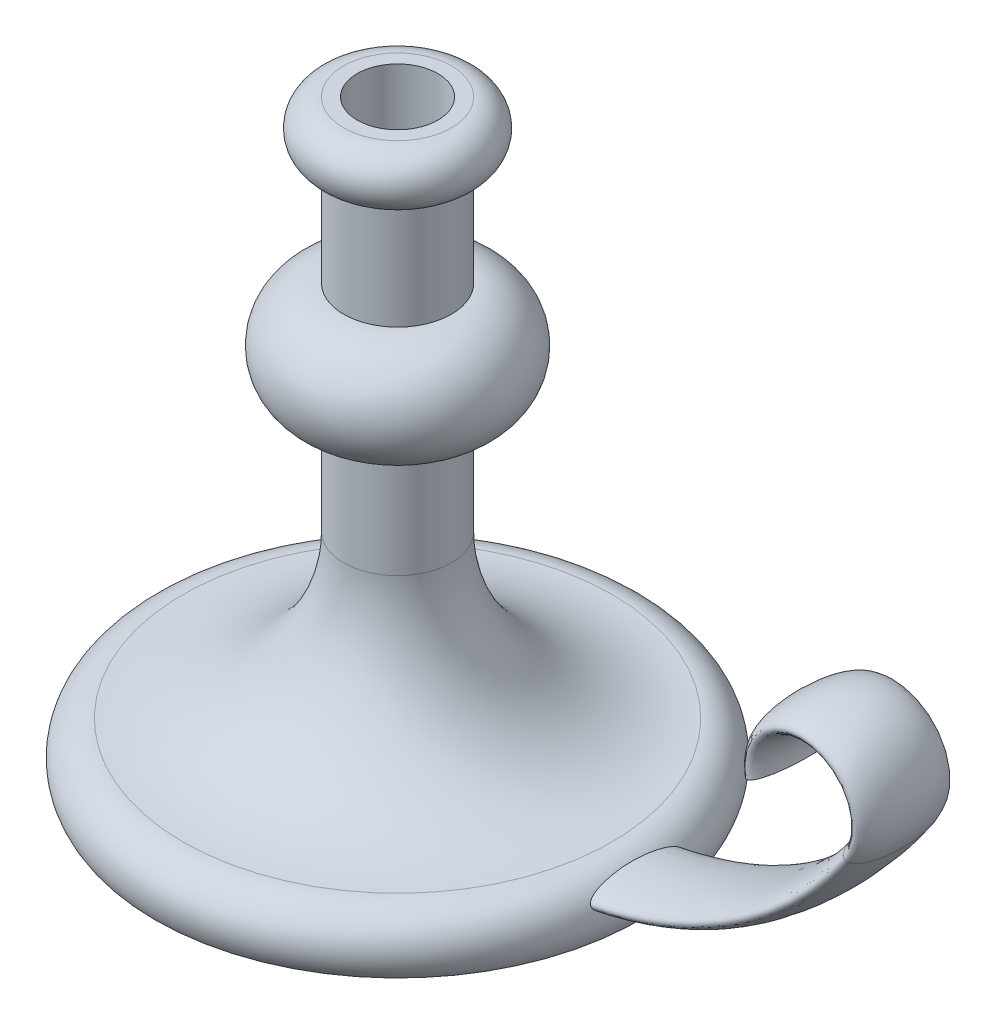
ISO-10303-21;
HEADER;
FILE_DESCRIPTION(('STEP AP214'),'2;1');
FILE_NAME('part.step','',(''),(''),'','','');
FILE_SCHEMA(('AUTOMOTIVE_DESIGN { 1 0 10303 214 1 1 1 1 }'));
ENDSEC;
DATA;
#1=APPLICATION_CONTEXT('core data for automotive mechanical design processes');
#2=APPLICATION_PROTOCOL_DEFINITION('international standard','automotive_design',2000,#1);
#3=PRODUCT_CONTEXT('',#1,'mechanical');
#4=PRODUCT('Part','Part','',(#3));
#5=PRODUCT_RELATED_PRODUCT_CATEGORY('part','',(#4));
#6=PRODUCT_DEFINITION_FORMATION('','',#4);
#7=PRODUCT_DEFINITION_CONTEXT('part definition',#1,'design');
#8=PRODUCT_DEFINITION('design','',#6,#7);
#9=PRODUCT_DEFINITION_SHAPE('','',#8);
#10=(LENGTH_UNIT() NAMED_UNIT(*) SI_UNIT(.MILLI.,.METRE.));
#11=(NAMED_UNIT(*) PLANE_ANGLE_UNIT() SI_UNIT($,.RADIAN.));
#12=(NAMED_UNIT(*) SI_UNIT($,.STERADIAN.) SOLID_ANGLE_UNIT());
#13=UNCERTAINTY_MEASURE_WITH_UNIT(LENGTH_MEASURE(1.E-05),#10,'distance_accuracy_value','');
#14=(GEOMETRIC_REPRESENTATION_CONTEXT(3) GLOBAL_UNCERTAINTY_ASSIGNED_CONTEXT((#13)) GLOBAL_UNIT_ASSIGNED_CONTEXT((#10,
#11,#12)) REPRESENTATION_CONTEXT('',''));
#15=CARTESIAN_POINT('',(0.,0.,0.));
#16=DIRECTION('',(0.,0.,1.));
#17=DIRECTION('',(1.,0.,0.));
#18=AXIS2_PLACEMENT_3D('',#15,#16,#17);
#19=CARTESIAN_POINT('',(0.,0.,0.));
#20=DIRECTION('',(0.,-1.,0.));
#21=DIRECTION('',(0.,0.,-1.));
#22=AXIS2_PLACEMENT_3D('',#19,#20,#21);
#23=PLANE('',#22);
#24=CARTESIAN_POINT('',(0.,0.,0.));
#25=DIRECTION('',(0.,-1.,0.));
#26=DIRECTION('',(0.,0.,-1.));
#27=AXIS2_PLACEMENT_3D('',#24,#25,#26);
#28=CIRCLE('',#27,90.);
#29=CARTESIAN_POINT('',(0.,0.,-90.));
#30=VERTEX_POINT('',#29);
#31=EDGE_CURVE('E79',#30,#30,#28,.T.);
#32=ORIENTED_EDGE('',*,*,#31,.T.);
#33=EDGE_LOOP('',(#32));
#34=FACE_BOUND('',#33,.T.);
#35=ADVANCED_FACE('F39',(#34),#23,.T.);
#36=CARTESIAN_POINT('',(0.,220.,0.));
#37=DIRECTION('',(0.,1.,0.));
#38=DIRECTION('',(0.,0.,1.));
#39=AXIS2_PLACEMENT_3D('',#36,#37,#38);
#40=PLANE('',#39);
#41=CARTESIAN_POINT('',(0.,220.,0.));
#42=DIRECTION('',(0.,1.,0.));
#43=DIRECTION('',(0.,0.,1.));
#44=AXIS2_PLACEMENT_3D('',#41,#42,#43);
#45=CIRCLE('',#44,15.);
#46=CARTESIAN_POINT('',(0.,220.,15.));
#47=VERTEX_POINT('',#46);
#48=EDGE_CURVE('E92',#47,#47,#45,.T.);
#49=ORIENTED_EDGE('',*,*,#48,.F.);
#50=EDGE_LOOP('',(#49));
#51=FACE_BOUND('',#50,.T.);
#52=CARTESIAN_POINT('',(0.,220.,0.));
#53=DIRECTION('',(0.,-1.,0.));
#54=DIRECTION('',(0.,0.,-1.));
#55=AXIS2_PLACEMENT_3D('',#52,#53,#54);
#56=CIRCLE('',#55,20.);
#57=CARTESIAN_POINT('',(0.,220.,-20.));
#58=VERTEX_POINT('',#57);
#59=EDGE_CURVE('E51',#58,#58,#56,.T.);
#60=ORIENTED_EDGE('',*,*,#59,.F.);
#61=EDGE_LOOP('',(#60));
#62=FACE_BOUND('',#61,.T.);
#63=ADVANCED_FACE('F110',(#51,#62),#40,.T.);
#64=CARTESIAN_POINT('',(0.,210.,0.));
#65=DIRECTION('',(0.,-1.,0.));
#66=DIRECTION('',(0.,0.,-1.));
#67=AXIS2_PLACEMENT_3D('',#64,#65,#66);
#68=TOROIDAL_SURFACE('',#67,20.,10.);
#69=ORIENTED_EDGE('',*,*,#59,.T.);
#70=EDGE_LOOP('',(#69));
#71=FACE_BOUND('',#70,.T.);
#72=CARTESIAN_POINT('',(0.,200.,0.));
#73=DIRECTION('',(0.,-1.,0.));
#74=DIRECTION('',(0.,0.,-1.));
#75=AXIS2_PLACEMENT_3D('',#72,#73,#74);
#76=CIRCLE('',#75,20.);
#77=CARTESIAN_POINT('',(0.,200.,-20.));
#78=VERTEX_POINT('',#77);
#79=EDGE_CURVE('E56',#78,#78,#76,.T.);
#80=ORIENTED_EDGE('',*,*,#79,.F.);
#81=EDGE_LOOP('',(#80));
#82=FACE_BOUND('',#81,.T.);
#83=ADVANCED_FACE('F113',(#71,#82),#68,.T.);
#84=CARTESIAN_POINT('',(0.,0.,0.));
#85=DIRECTION('',(0.,-1.,0.));
#86=DIRECTION('',(0.,0.,-1.));
#87=AXIS2_PLACEMENT_3D('',#84,#85,#86);
#88=CYLINDRICAL_SURFACE('',#87,20.);
#89=ORIENTED_EDGE('',*,*,#79,.T.);
#90=EDGE_LOOP('',(#89));
#91=FACE_BOUND('',#90,.T.);
#92=CARTESIAN_POINT('',(0.,160.,0.));
#93=DIRECTION('',(0.,-1.,0.));
#94=DIRECTION('',(0.,0.,-1.));
#95=AXIS2_PLACEMENT_3D('',#92,#93,#94);
#96=CIRCLE('',#95,20.);
#97=CARTESIAN_POINT('',(0.,160.,-20.));
#98=VERTEX_POINT('',#97);
#99=EDGE_CURVE('E61',#98,#98,#96,.T.);
#100=ORIENTED_EDGE('',*,*,#99,.F.);
#101=EDGE_LOOP('',(#100));
#102=FACE_BOUND('',#101,.T.);
#103=ADVANCED_FACE('F118',(#91,#102),#88,.T.);
#104=CARTESIAN_POINT('',(0.,140.,0.));
#105=DIRECTION('',(0.,-1.,0.));
#106=DIRECTION('',(0.,0.,-1.));
#107=AXIS2_PLACEMENT_3D('',#104,#105,#106);
#108=TOROIDAL_SURFACE('',#107,20.,20.);
#109=ORIENTED_EDGE('',*,*,#99,.T.);
#110=EDGE_LOOP('',(#109));
#111=FACE_BOUND('',#110,.T.);
#112=CARTESIAN_POINT('',(0.,120.,0.));
#113=DIRECTION('',(0.,-1.,0.));
#114=DIRECTION('',(0.,0.,-1.));
#115=AXIS2_PLACEMENT_3D('',#112,#113,#114);
#116=CIRCLE('',#115,20.);
#117=CARTESIAN_POINT('',(0.,120.,-20.));
#118=VERTEX_POINT('',#117);
#119=EDGE_CURVE('E67',#118,#118,#116,.T.);
#120=ORIENTED_EDGE('',*,*,#119,.F.);
#121=EDGE_LOOP('',(#120));
#122=FACE_BOUND('',#121,.T.);
#123=ADVANCED_FACE('F124',(#111,#122),#108,.T.);
#124=CARTESIAN_POINT('',(0.,0.,0.));
#125=DIRECTION('',(0.,-1.,0.));
#126=DIRECTION('',(0.,0.,-1.));
#127=AXIS2_PLACEMENT_3D('',#124,#125,#126);
#128=CYLINDRICAL_SURFACE('',#127,20.);
#129=ORIENTED_EDGE('',*,*,#119,.T.);
#130=EDGE_LOOP('',(#129));
#131=FACE_BOUND('',#130,.T.);
#132=CARTESIAN_POINT('',(0.,80.,0.));
#133=DIRECTION('',(0.,-1.,0.));
#134=DIRECTION('',(0.,0.,-1.));
#135=AXIS2_PLACEMENT_3D('',#132,#133,#134);
#136=CIRCLE('',#135,20.);
#137=CARTESIAN_POINT('',(0.,80.,-20.));
#138=VERTEX_POINT('',#137);
#139=EDGE_CURVE('E71',#138,#138,#136,.T.);
#140=ORIENTED_EDGE('',*,*,#139,.F.);
#141=EDGE_LOOP('',(#140));
#142=FACE_BOUND('',#141,.T.);
#143=ADVANCED_FACE('F128',(#131,#142),#128,.T.);
#144=CARTESIAN_POINT('',(0.,80.,0.));
#145=DIRECTION('',(0.,-1.,0.));
#146=DIRECTION('',(0.,0.,-1.));
#147=AXIS2_PLACEMENT_3D('',#144,#145,#146);
#148=TOROIDAL_SURFACE('',#147,80.,60.);
#149=ORIENTED_EDGE('',*,*,#139,.T.);
#150=EDGE_LOOP('',(#149));
#151=FACE_BOUND('',#150,.T.);
#152=CARTESIAN_POINT('',(0.,20.0007443694136,0.));
#153=DIRECTION('',(0.,-1.,0.));
#154=DIRECTION('',(0.,0.,-1.));
#155=AXIS2_PLACEMENT_3D('',#152,#153,#154);
#156=CIRCLE('',#155,79.7011291657719);
#157=CARTESIAN_POINT('',(0.,20.0007443694136,-79.7011291657719));
#158=VERTEX_POINT('',#157);
#159=EDGE_CURVE('E75',#158,#158,#156,.T.);
#160=ORIENTED_EDGE('',*,*,#159,.F.);
#161=EDGE_LOOP('',(#160));
#162=FACE_BOUND('',#161,.T.);
#163=ADVANCED_FACE('F132',(#151,#162),#148,.F.);
#164=CARTESIAN_POINT('',(0.,7.31626714425586,0.));
#165=DIRECTION('',(0.,-1.,0.));
#166=DIRECTION('',(0.,0.,-1.));
#167=AXIS2_PLACEMENT_3D('',#164,#165,#166);
#168=TOROIDAL_SURFACE('',#167,79.6379447103951,12.6846345927247);
#169=CARTESIAN_POINT('',(89.331592359006,12.8957591036713,17.5));
#170=CARTESIAN_POINT('',(89.3528716315899,12.8531232664558,17.5000036298484));
#171=CARTESIAN_POINT('',(89.3742501925081,12.8105547612886,17.4977749194986));
#172=CARTESIAN_POINT('',(89.417043392844,12.7258834846006,17.4889673870824));
#173=CARTESIAN_POINT('',(89.4384580379587,12.6837807965263,17.4823877980299));
#174=CARTESIAN_POINT('',(89.5025363259207,12.5586045254097,17.456393580704));
#175=CARTESIAN_POINT('',(89.5450197770193,12.4766918736474,17.4307237235594));
#176=CARTESIAN_POINT('',(89.6406017454437,12.2946910967917,17.355926513326));
#177=CARTESIAN_POINT('',(89.6931706980714,12.1962942561243,17.3021342095068));
#178=CARTESIAN_POINT('',(89.7948763242913,12.0087598824078,17.1777574554219));
#179=CARTESIAN_POINT('',(89.844003949467,11.9196464797963,17.1071307391182));
#180=CARTESIAN_POINT('',(89.9330537848641,11.7603446608938,16.9633621664622));
#181=CARTESIAN_POINT('',(89.973374135657,11.6891676003732,16.8915321206787));
#182=CARTESIAN_POINT('',(90.051537415588,11.552758939122,16.741128077223));
#183=CARTESIAN_POINT('',(90.0893782142737,11.4875324327647,16.6625484107612));
#184=CARTESIAN_POINT('',(90.1628708848921,11.3621997381895,16.5002316378956));
#185=CARTESIAN_POINT('',(90.198518700364,11.3021029635716,16.4164855157216));
#186=CARTESIAN_POINT('',(90.2677931344468,11.1864799888541,16.2451597473206));
#187=CARTESIAN_POINT('',(90.3014203342554,11.1309524727662,16.1575812160722));
#188=CARTESIAN_POINT('',(90.3714571178723,11.0163813355403,15.9669622665593));
#189=CARTESIAN_POINT('',(90.4075996960735,10.957929166113,15.8634702414445));
#190=CARTESIAN_POINT('',(90.4778389759083,10.8454518468641,15.6534350197472));
#191=CARTESIAN_POINT('',(90.5119354406711,10.7914272093371,15.5468914720025));
#192=CARTESIAN_POINT('',(90.5782505385626,10.6873201846696,15.3315569876787));
#193=CARTESIAN_POINT('',(90.6104720603554,10.6372316891334,15.222769877891));
#194=CARTESIAN_POINT('',(90.673275686305,10.540443972785,15.0032494469884));
#195=CARTESIAN_POINT('',(90.7038578886355,10.493744548953,14.8925162429473));
#196=CARTESIAN_POINT('',(90.7737583891013,10.3878677608794,14.6312336071376));
#197=CARTESIAN_POINT('',(90.8124812173465,10.3298949948671,14.4800371070918));
#198=CARTESIAN_POINT('',(90.8875472436256,10.2186232524545,14.1753399722133));
#199=CARTESIAN_POINT('',(90.9238901049236,10.1653249370708,14.021839015089));
#200=CARTESIAN_POINT('',(90.9944609048068,10.0627775363203,13.7128145380783));
#201=CARTESIAN_POINT('',(91.0286864280601,10.0135330549033,13.557288944686));
#202=CARTESIAN_POINT('',(91.0951630132822,9.91869953725797,13.244704908244));
#203=CARTESIAN_POINT('',(91.1274139478919,9.87311073675893,13.0876463670766));
#204=CARTESIAN_POINT('',(91.2214665821271,9.74120657190673,12.6144069914983));
#205=CARTESIAN_POINT('',(91.2805355176612,9.65980049269619,12.2963069613394));
#206=CARTESIAN_POINT('',(91.3925695029603,9.50742822340805,11.6548154303461));
#207=CARTESIAN_POINT('',(91.4455014603195,9.43651811031221,11.3314050880674));
#208=CARTESIAN_POINT('',(91.5455046163852,9.30408939971677,10.6820437671839));
#209=CARTESIAN_POINT('',(91.5925802615152,9.24256366897103,10.356094918241));
#210=CARTESIAN_POINT('',(91.6813705724448,9.12767540315217,9.70210271905873));
#211=CARTESIAN_POINT('',(91.7230860774511,9.07431158996437,9.37405970515349));
#212=CARTESIAN_POINT('',(91.80210205921,8.97410128813368,8.71129392750408));
#213=CARTESIAN_POINT('',(91.8393259731192,8.92736592912732,8.3765453165988));
#214=CARTESIAN_POINT('',(91.9088792561761,8.84069383195887,7.70566141492581));
#215=CARTESIAN_POINT('',(91.9412084483891,8.80075733955607,7.36952607448149));
#216=CARTESIAN_POINT('',(92.0311897061726,8.69028861732564,6.35930166729121));
#217=CARTESIAN_POINT('',(92.0818184338585,8.62911846282349,5.68353887282034));
#218=CARTESIAN_POINT('',(92.1653544449105,8.528915699696,4.33105522544168));
#219=CARTESIAN_POINT('',(92.1983056977362,8.48982815166778,3.65434098679839));
#220=CARTESIAN_POINT('',(92.2472906751491,8.43192360316733,2.29942023089839));
#221=CARTESIAN_POINT('',(92.2633239958661,8.41310708661115,1.62121367840398));
#222=CARTESIAN_POINT('',(92.2778397445579,8.39607181650987,0.343960471331731));
#223=CARTESIAN_POINT('',(92.2781604370463,8.39569566899582,-0.255039117845261));
#224=CARTESIAN_POINT('',(92.2658325466088,8.41016273961668,-1.4528166686833));
#225=CARTESIAN_POINT('',(92.253182027507,8.4250082298421,-2.05159458390782));
#226=CARTESIAN_POINT('',(92.2147353255428,8.470380034667,-3.24833655747918));
#227=CARTESIAN_POINT('',(92.1889348979051,8.50091141267835,-3.84630029047619));
#228=CARTESIAN_POINT('',(92.1237707343957,8.57870111012282,-5.0412990932736));
#229=CARTESIAN_POINT('',(92.084386974914,8.62598412648128,-5.63833147758658));
#230=CARTESIAN_POINT('',(91.991450603915,8.73891348371119,-6.82944653891416));
#231=CARTESIAN_POINT('',(91.9379017463258,8.80455495962487,-7.42352995500957));
#232=CARTESIAN_POINT('',(91.8462001332358,8.91878741069747,-8.31126483343779));
#233=CARTESIAN_POINT('',(91.8137459250727,8.95948131605918,-8.60653918163226));
#234=CARTESIAN_POINT('',(91.7448551252587,9.04661442029298,-9.19576808539778));
#235=CARTESIAN_POINT('',(91.7084187102134,9.09305336439224,-9.48972269889588));
#236=CARTESIAN_POINT('',(91.6313131503896,9.19229484905741,-10.0761621606462));
#237=CARTESIAN_POINT('',(91.5906418354418,9.24510065452449,-10.3686461740147));
#238=CARTESIAN_POINT('',(91.5047743899102,9.35783568382189,-10.9516205734937));
#239=CARTESIAN_POINT('',(91.4595776645317,9.417765844232,-11.242110692162));
#240=CARTESIAN_POINT('',(91.3642333240636,9.54579722051748,-11.8206934470067));
#241=CARTESIAN_POINT('',(91.3140824035886,9.61390389828953,-12.1087843415796));
#242=CARTESIAN_POINT('',(91.2083961647205,9.75950694534379,-12.6811132804984));
#243=CARTESIAN_POINT('',(91.1528693058418,9.83698860874519,-12.9653566009956));
#244=CARTESIAN_POINT('',(91.0356437753436,10.003260298756,-13.529135914604));
#245=CARTESIAN_POINT('',(90.9739482389594,10.0920445870036,-13.8086742154847));
#246=CARTESIAN_POINT('',(90.8759775106589,10.235723217141,-14.2228866134028));
#247=CARTESIAN_POINT('',(90.842433310285,10.2853403122764,-14.3600440737252));
#248=CARTESIAN_POINT('',(90.7733376340875,10.3885611124623,-14.6323323486204));
#249=CARTESIAN_POINT('',(90.7377863518709,10.4421644331516,-14.7674633570825));
#250=CARTESIAN_POINT('',(90.6607763579514,10.5595243741388,-15.0486247180798));
#251=CARTESIAN_POINT('',(90.619082520898,10.6237602414905,-15.1943922927362));
#252=CARTESIAN_POINT('',(90.5325813159539,10.7587579555331,-15.4820339503066));
#253=CARTESIAN_POINT('',(90.4877727417693,10.8295223341353,-15.6239064947225));
#254=CARTESIAN_POINT('',(90.3947481854828,10.9785316692766,-15.9017182872334));
#255=CARTESIAN_POINT('',(90.3465474135609,11.0567437272694,-16.0376800885217));
#256=CARTESIAN_POINT('',(90.245957850172,11.2225349834868,-16.3020758844232));
#257=CARTESIAN_POINT('',(90.1935732428495,11.3101048521198,-16.4305171826557));
#258=CARTESIAN_POINT('',(90.0950078431896,11.4777705158856,-16.6512777465277));
#259=CARTESIAN_POINT('',(90.0497481753715,11.5557343019329,-16.7456135259041));
#260=CARTESIAN_POINT('',(89.9554721128961,11.720591315673,-16.9246930831411));
#261=CARTESIAN_POINT('',(89.906449449035,11.8074995307326,-17.0094202446332));
#262=CARTESIAN_POINT('',(89.8296045202293,11.9459851277386,-17.1262686815797));
#263=CARTESIAN_POINT('',(89.8032390846774,11.9938693169556,-17.1637389684981));
#264=CARTESIAN_POINT('',(89.7494837402016,12.0923289163028,-17.2342002888381));
#265=CARTESIAN_POINT('',(89.722093698745,12.1429046749473,-17.2671907402202));
#266=CARTESIAN_POINT('',(89.6664470358401,12.2465607097923,-17.3276633715996));
#267=CARTESIAN_POINT('',(89.638193560291,12.2996322030883,-17.355163308521));
#268=CARTESIAN_POINT('',(89.5809128237969,12.4081943999189,-17.4037677528346));
#269=CARTESIAN_POINT('',(89.5518860867268,12.4636834809888,-17.4248764760473));
#270=CARTESIAN_POINT('',(89.483222479244,12.596139523701,-17.4657054782123));
#271=CARTESIAN_POINT('',(89.4433623818072,12.6739432337966,-17.4824642549507));
#272=CARTESIAN_POINT('',(89.3637017821655,12.8313154890446,-17.5008355582578));
#273=CARTESIAN_POINT('',(89.3239012577142,12.910882722149,-17.502458989763));
#274=CARTESIAN_POINT('',(89.2455102181624,13.0693757470002,-17.4902982190755));
#275=CARTESIAN_POINT('',(89.2069192396707,13.1483017755984,-17.4765199934856));
#276=CARTESIAN_POINT('',(89.1318434533162,13.3034102691417,-17.4349447077809));
#277=CARTESIAN_POINT('',(89.095360855041,13.3795898254266,-17.4071332274237));
#278=CARTESIAN_POINT('',(89.0107284365554,13.5578748719522,-17.3261632367215));
#279=CARTESIAN_POINT('',(88.9638469155511,13.6579660745915,-17.2672994741846));
#280=CARTESIAN_POINT('',(88.8752468009856,13.8489495323135,-17.1331172581495));
#281=CARTESIAN_POINT('',(88.8335416103374,13.9398178003752,-17.0577574295354));
#282=CARTESIAN_POINT('',(88.7588108430003,14.1038379686959,-16.9041719662642));
#283=CARTESIAN_POINT('',(88.7253336696562,14.1778494650969,-16.8270606350012));
#284=CARTESIAN_POINT('',(88.6614671569186,14.3197569733581,-16.6661582628088));
#285=CARTESIAN_POINT('',(88.6310805325556,14.387647602225,-16.5823614620815));
#286=CARTESIAN_POINT('',(88.5728570912034,14.5182080538585,-16.4096516177783));
#287=CARTESIAN_POINT('',(88.5450267582966,14.5808645656565,-16.3207264471473));
#288=CARTESIAN_POINT('',(88.4915926302374,14.7014631877479,-16.139166948396));
#289=CARTESIAN_POINT('',(88.4659880378696,14.7594069855583,-16.0465339658467));
#290=CARTESIAN_POINT('',(88.4162633044117,14.8720977924002,-15.8568660767383));
#291=CARTESIAN_POINT('',(88.392173279038,14.926779236368,-15.7597845729235));
#292=CARTESIAN_POINT('',(88.3456463173741,15.0324480575824,-15.56323584348));
#293=CARTESIAN_POINT('',(88.3232096749754,15.0834347780592,-15.4637681978556));
#294=CARTESIAN_POINT('',(88.2579617276854,15.2316648274762,-15.162195159253));
#295=CARTESIAN_POINT('',(88.2172871763785,15.3240079881752,-14.9572136843656));
#296=CARTESIAN_POINT('',(88.1402735962302,15.4982932943206,-14.5419563709813));
#297=CARTESIAN_POINT('',(88.1039383710524,15.5802263186583,-14.3316760804489));
#298=CARTESIAN_POINT('',(88.0346037188983,15.7357645468321,-13.90647004583));
#299=CARTESIAN_POINT('',(88.0016195831202,15.8093317442382,-13.6915280015502));
#300=CARTESIAN_POINT('',(87.9385811329796,15.9489866103288,-13.259096277495));
#301=CARTESIAN_POINT('',(87.9085235640724,16.0150826009927,-13.0416097361016));
#302=CARTESIAN_POINT('',(87.8508656630047,16.1408735494464,-12.6045456099856));
#303=CARTESIAN_POINT('',(87.8232646855787,16.2005701889817,-12.3849685912364));
#304=CARTESIAN_POINT('',(87.7636985636154,16.3282797050062,-11.8901725135972));
#305=CARTESIAN_POINT('',(87.7323183455989,16.3947527138723,-11.6144865183409));
#306=CARTESIAN_POINT('',(87.6724276272482,16.5201523600373,-11.0610808271048));
#307=CARTESIAN_POINT('',(87.6439174018875,16.5790782743972,-10.7833609389873));
#308=CARTESIAN_POINT('',(87.5894700969832,16.6902641866094,-10.2262012323957));
#309=CARTESIAN_POINT('',(87.563534290015,16.7425208913776,-9.94676063511619));
#310=CARTESIAN_POINT('',(87.5140610849197,16.8410016965775,-9.38660255069569));
#311=CARTESIAN_POINT('',(87.4905237968001,16.8872255203401,-9.10588500560411));
#312=CARTESIAN_POINT('',(87.4234454451566,17.0174088308054,-8.26387531041082));
#313=CARTESIAN_POINT('',(87.3832752040462,17.0932090143356,-7.70103951583022));
#314=CARTESIAN_POINT('',(87.3114739326301,17.2260446214976,-6.57279812325387));
#315=CARTESIAN_POINT('',(87.2798409934517,17.2830842404669,-6.0073931285074));
#316=CARTESIAN_POINT('',(87.2250955058804,17.3802696449732,-4.87615781282562));
#317=CARTESIAN_POINT('',(87.2019618684402,17.4204572803456,-4.31033208345654));
#318=CARTESIAN_POINT('',(87.1641805820016,17.4854146083387,-3.17749023414733));
#319=CARTESIAN_POINT('',(87.1495334330816,17.510183392388,-2.61047404603318));
#320=CARTESIAN_POINT('',(87.1288289686007,17.5450408981076,-1.47561664407422));
#321=CARTESIAN_POINT('',(87.1227750129476,17.5551238777209,-0.907775194372782));
#322=CARTESIAN_POINT('',(87.1193237820083,17.5608842905552,0.227987776251134));
#323=CARTESIAN_POINT('',(87.1219261642648,17.5565622936579,0.795909293117199));
#324=CARTESIAN_POINT('',(87.1344455598773,17.5355868628083,1.82339056913373));
#325=CARTESIAN_POINT('',(87.1428776455311,17.5214344484496,2.2830215329929));
#326=CARTESIAN_POINT('',(87.165354479205,17.483320341416,3.20173858962035));
#327=CARTESIAN_POINT('',(87.1793991549583,17.4593587750421,3.66082468932789));
#328=CARTESIAN_POINT('',(87.21304222729,17.4011576428215,4.57806436661276));
#329=CARTESIAN_POINT('',(87.2326396743792,17.3669198340889,5.03621809014247));
#330=CARTESIAN_POINT('',(87.27735289828,17.2874532320298,5.95129709759704));
#331=CARTESIAN_POINT('',(87.3024684667521,17.2422248536509,6.40822242724142));
#332=CARTESIAN_POINT('',(87.3491991993318,17.1563873224842,7.17228098420321));
#333=CARTESIAN_POINT('',(87.3693028838554,17.1190469792123,7.47987660342441));
#334=CARTESIAN_POINT('',(87.4120924938199,17.0384628386665,8.09411160670261));
#335=CARTESIAN_POINT('',(87.4347783585978,16.9952191800739,8.40075101305005));
#336=CARTESIAN_POINT('',(87.4828159617157,16.9023160980562,9.01276460373634));
#337=CARTESIAN_POINT('',(87.5081669758935,16.8526584165859,9.31813910844866));
#338=CARTESIAN_POINT('',(87.5616923150876,16.7462533017768,9.92740188743243));
#339=CARTESIAN_POINT('',(87.5898665440548,16.6895061096155,10.2312902118968));
#340=CARTESIAN_POINT('',(87.6404095389,16.5862010558457,10.7466522816931));
#341=CARTESIAN_POINT('',(87.661997625522,16.5416649124325,10.9586085960539));
#342=CARTESIAN_POINT('',(87.7068092076462,16.4483037303251,11.3813988712093));
#343=CARTESIAN_POINT('',(87.7300326550759,16.3994788176918,11.5922328647994));
#344=CARTESIAN_POINT('',(87.7782956292146,16.2970511976029,12.012664729903));
#345=CARTESIAN_POINT('',(87.8033362096123,16.2434457138786,12.2222618067706));
#346=CARTESIAN_POINT('',(87.8554462296387,16.1309098617006,12.6397681020805));
#347=CARTESIAN_POINT('',(87.882515605796,16.0719796598199,12.8476773731007));
#348=CARTESIAN_POINT('',(87.9384106163237,15.9493381868072,13.2571267957373));
#349=CARTESIAN_POINT('',(87.9671887834081,15.8857499142039,13.4587100740162));
#350=CARTESIAN_POINT('',(88.02737820529,15.7518889749847,13.8592458384641));
#351=CARTESIAN_POINT('',(88.058789234617,15.6816168806823,14.0581985482214));
#352=CARTESIAN_POINT('',(88.1247800039194,15.5332512700918,14.4525556682108));
#353=CARTESIAN_POINT('',(88.1593584324042,15.4551609897611,14.64796150726));
#354=CARTESIAN_POINT('',(88.2324559024922,15.2895883406964,15.0339849567474));
#355=CARTESIAN_POINT('',(88.2709734269471,15.2021095873093,15.2246043757119));
#356=CARTESIAN_POINT('',(88.3344351128477,15.0579283496447,15.5139045689998));
#357=CARTESIAN_POINT('',(88.3575955831162,15.0052999424311,15.6150095331601));
#358=CARTESIAN_POINT('',(88.4056857955521,14.8961074482309,15.8146327216121));
#359=CARTESIAN_POINT('',(88.4306152090903,14.8395440923062,15.913151421738));
#360=CARTESIAN_POINT('',(88.4825569322437,14.721907889443,16.1069052802867));
#361=CARTESIAN_POINT('',(88.5095691614144,14.6608352166714,16.2021405653194));
#362=CARTESIAN_POINT('',(88.5660632571339,14.533499751445,16.3883056231103));
#363=CARTESIAN_POINT('',(88.5955442272001,14.467238843575,16.4792369401694));
#364=CARTESIAN_POINT('',(88.6468225484703,14.3525118896444,16.6250678854621));
#365=CARTESIAN_POINT('',(88.6677764252503,14.3057610043701,16.6816062204874));
#366=CARTESIAN_POINT('',(88.7111186114716,14.2094154985263,16.7916201337275));
#367=CARTESIAN_POINT('',(88.7335071924788,14.1598203397704,16.845095128453));
#368=CARTESIAN_POINT('',(88.8030278722002,14.0064961524021,16.9997389447878));
#369=CARTESIAN_POINT('',(88.8526124678244,13.8980089778055,17.0954154709312));
#370=CARTESIAN_POINT('',(88.9415230587185,13.705959011399,17.2351168874825));
#371=CARTESIAN_POINT('',(88.9787232364164,13.6262169849745,17.2857089605743));
#372=CARTESIAN_POINT('',(89.0565936578377,13.4609890820443,17.3729355384276));
#373=CARTESIAN_POINT('',(89.0972567305421,13.3755151497378,17.4095980678659));
#374=CARTESIAN_POINT('',(89.1701600842742,13.2240691632156,17.4578764099612));
#375=CARTESIAN_POINT('',(89.201709335693,13.1590643163121,17.4735824653783));
#376=CARTESIAN_POINT('',(89.2659573398479,13.0279054584701,17.4946406543723));
#377=CARTESIAN_POINT('',(89.2986559148603,12.9617516259964,17.4999943816549));
#378=CARTESIAN_POINT('',(89.331592359006,12.8957591036713,17.5));
#379=B_SPLINE_CURVE_WITH_KNOTS('',3,(#169,#170,#171,#172,#173,#174,#175,#176,#177,#178,#179,
#180,#181,#182,#183,#184,#185,#186,#187,#188,#189,#190,#191,#192,#193,#194,#195,#196,#197,#198,
#199,#200,#201,#202,#203,#204,#205,#206,#207,#208,#209,#210,#211,#212,#213,#214,#215,#216,#217,
#218,#219,#220,#221,#222,#223,#224,#225,#226,#227,#228,#229,#230,#231,#232,#233,#234,#235,#236,
#237,#238,#239,#240,#241,#242,#243,#244,#245,#246,#247,#248,#249,#250,#251,#252,#253,#254,#255,
#256,#257,#258,#259,#260,#261,#262,#263,#264,#265,#266,#267,#268,#269,#270,#271,#272,#273,#274,
#275,#276,#277,#278,#279,#280,#281,#282,#283,#284,#285,#286,#287,#288,#289,#290,#291,#292,#293,
#294,#295,#296,#297,#298,#299,#300,#301,#302,#303,#304,#305,#306,#307,#308,#309,#310,#311,#312,
#313,#314,#315,#316,#317,#318,#319,#320,#321,#322,#323,#324,#325,#326,#327,#328,#329,#330,#331,
#332,#333,#334,#335,#336,#337,#338,#339,#340,#341,#342,#343,#344,#345,#346,#347,#348,#349,#350,
#351,#352,#353,#354,#355,#356,#357,#358,#359,#360,#361,#362,#363,#364,#365,#366,#367,#368,#369,
#370,#371,#372,#373,#374,#375,#376,#377,#378),.UNSPECIFIED.,.T.,.F.,(4,2,2,2,2,2,2,2,2,2,2,2,2,
2,2,2,2,2,2,2,2,2,2,2,2,2,2,2,2,2,2,2,2,2,2,2,2,2,2,2,2,2,2,2,2,2,2,2,2,2,2,2,2,2,2,2,2,2,2,2,2,
2,2,2,2,2,2,2,2,2,2,2,2,2,2,2,2,2,2,2,2,2,2,2,2,2,2,2,2,2,2,2,2,2,2,2,2,2,2,2,2,2,2,2,4),(0.,
0.142871130676715,0.285767453826701,0.571656342954518,0.941162647848684,1.31160662711154,
1.63773130893978,1.96413262189904,2.29112058519849,2.6180140409261,2.99054648209707,
3.36312196704892,3.73510734954214,4.10707043009936,4.60643388797761,5.10586784764714,
5.60586140755434,6.10588718267089,7.1064046434528,8.1120882927423,9.11700365192395,
10.1217614850111,11.1417591811313,12.1617937393817,14.2023040305025,16.2377151159935,
18.2731747903408,20.06985262205,21.866798677788,23.6643251533404,25.4645128246685,
27.2642239008725,28.1636369379067,29.0630101033338,29.9628464410653,30.8628012038988,
31.7633605150741,32.6625250631046,33.5612349108893,34.0101620807981,34.4590460200965,
34.9528573545866,35.4468610124018,35.9387756754464,36.4302044037402,36.8211660755513,
37.2127938546731,37.411439858664,37.6101116469578,37.8081301128386,38.0060176742879,
38.2718036811643,38.5373981758089,38.8028896424534,39.0686544791582,39.4421945936006,
39.8166825743099,40.1522002264279,40.4880101282851,40.8246495642241,41.1611679215234,
41.5030427526031,41.8449782066576,42.5298898549097,43.2153975274471,43.9039045966367,
44.5916370372081,45.2791882967364,46.1349942070956,46.9908820342275,47.8471908549941,
48.7035389324694,50.4110614233153,52.1182018088452,53.821077247168,55.5240530196625,
57.2276944663687,58.9312685153595,60.3109169432188,61.6905476074964,63.0699425057426,
64.4492853331921,65.3807421670122,66.3121771226905,67.2433596440495,68.1745104962037,
68.8274405731581,69.4803514648104,70.1336440283002,70.7869161619312,71.426776144862,
72.0665813879447,72.7061229010909,73.3454190150207,73.6942680956393,74.0430525368658,
74.3918235137488,74.7404683849102,74.9692353594728,75.1980457644962,75.6545461783821,
75.9581623511506,76.2611644062994,76.4823369857487,76.7034755137229),.UNSPECIFIED.);
#380=CARTESIAN_POINT('',(89.331592359006,12.8957591036713,17.5));
#381=VERTEX_POINT('',#380);
#382=EDGE_CURVE('E10',#381,#381,#379,.T.);
#383=ORIENTED_EDGE('',*,*,#382,.F.);
#384=EDGE_LOOP('',(#383));
#385=FACE_BOUND('',#384,.T.);
#386=ORIENTED_EDGE('',*,*,#159,.T.);
#387=EDGE_LOOP('',(#386));
#388=FACE_BOUND('',#387,.T.);
#389=ORIENTED_EDGE('',*,*,#31,.F.);
#390=EDGE_LOOP('',(#389));
#391=FACE_BOUND('',#390,.T.);
#392=ADVANCED_FACE('F135',(#385,#388,#391),#168,.T.);
#393=CARTESIAN_POINT('',(147.448696612485,82.6850279349348,0.));
#394=DIRECTION('',(0.182415269919928,-0.983221576909315,0.));
#395=DIRECTION('',(0.,0.,-1.));
#396=AXIS2_PLACEMENT_3D('',#393,#394,#395);
#397=PLANE('',#396);
#398=CARTESIAN_POINT('',(147.448696612485,82.6850279349348,0.));
#399=DIRECTION('',(0.182415269919928,-0.983221576909315,0.));
#400=DIRECTION('',(0.,0.,1.));
#401=AXIS2_PLACEMENT_3D('',#398,#399,#400);
#402=ELLIPSE('',#401,17.5,5.);
#403=CARTESIAN_POINT('',(147.448696612485,82.6850279349348,17.5));
#404=VERTEX_POINT('',#403);
#405=EDGE_CURVE('E83',#404,#404,#402,.T.);
#406=ORIENTED_EDGE('',*,*,#405,.T.);
#407=EDGE_LOOP('',(#406));
#408=FACE_BOUND('',#407,.T.);
#409=ADVANCED_FACE('F107',(#408),#397,.T.);
#410=CARTESIAN_POINT('',(60.,10.,17.5));
#411=CARTESIAN_POINT('',(110.410191303973,9.99999999999999,17.5));
#412=CARTESIAN_POINT('',(155.026295870831,33.4646670673665,17.5));
#413=CARTESIAN_POINT('',(183.592070943083,74.9999999999999,17.5));
#414=CARTESIAN_POINT('',(60.,0.,17.5));
#415=CARTESIAN_POINT('',(113.770870724238,0.,17.5));
#416=CARTESIAN_POINT('',(161.36138226222,25.0289782051909,17.5));
#417=CARTESIAN_POINT('',(191.831542339288,69.3333333333333,17.5));
#418=CARTESIAN_POINT('',(60.,0.,-17.5));
#419=CARTESIAN_POINT('',(113.770870724238,0.,-17.5));
#420=CARTESIAN_POINT('',(161.36138226222,25.0289782051909,-17.5));
#421=CARTESIAN_POINT('',(191.831542339288,69.3333333333333,-17.5));
#422=CARTESIAN_POINT('',(60.,10.,-17.5));
#423=CARTESIAN_POINT('',(110.410191303973,9.99999999999999,-17.5));
#424=CARTESIAN_POINT('',(155.026295870831,33.4646670673665,-17.5));
#425=CARTESIAN_POINT('',(183.592070943083,74.9999999999999,-17.5));
#426=CARTESIAN_POINT('',(60.,20.,-17.5));
#427=CARTESIAN_POINT('',(107.049511883708,20.,-17.5));
#428=CARTESIAN_POINT('',(148.691209479443,41.900355929542,-17.5));
#429=CARTESIAN_POINT('',(175.352599546877,80.6666666666666,-17.5));
#430=CARTESIAN_POINT('',(60.,20.,17.5));
#431=CARTESIAN_POINT('',(107.049511883708,20.,17.5));
#432=CARTESIAN_POINT('',(148.691209479443,41.900355929542,17.5));
#433=CARTESIAN_POINT('',(175.352599546877,80.6666666666666,17.5));
#434=CARTESIAN_POINT('',(60.,10.,17.5));
#435=CARTESIAN_POINT('',(110.410191303973,9.99999999999999,17.5));
#436=CARTESIAN_POINT('',(155.026295870831,33.4646670673665,17.5));
#437=CARTESIAN_POINT('',(183.592070943083,74.9999999999999,17.5));
#438=(BOUNDED_SURFACE() B_SPLINE_SURFACE(3,3,((#410,#411,#412,#413),(#414,#415,#416,#417),(#418,
#419,#420,#421),(#422,#423,#424,#425),(#426,#427,#428,#429),(#430,#431,#432,#433),(#434,#435,
#436,#437)),.UNSPECIFIED.,.T.,.F.,.F.) B_SPLINE_SURFACE_WITH_KNOTS((4,3,4),(4,4),(0.,0.5,1.),
(0.,1.),.UNSPECIFIED.) GEOMETRIC_REPRESENTATION_ITEM() RATIONAL_B_SPLINE_SURFACE(((1.,
0.923374135437856,0.923374135437856,1.),(0.333333333333333,0.307791378479285,0.307791378479285,
0.333333333333333),(0.333333333333333,0.307791378479285,0.307791378479285,0.333333333333333),
(1.,0.923374135437856,0.923374135437856,1.),(0.333333333333333,0.307791378479285,
0.307791378479285,0.333333333333333),(0.333333333333333,0.307791378479285,0.307791378479285,
0.333333333333333),(1.,0.923374135437856,0.923374135437856,1.))) REPRESENTATION_ITEM('') SURFACE());
#439=CARTESIAN_POINT('',(183.592070943083,75.,0.));
#440=DIRECTION('',(0.566666666666667,0.823947139620552,0.));
#441=DIRECTION('',(0.,0.,1.));
#442=AXIS2_PLACEMENT_3D('',#439,#440,#441);
#443=ELLIPSE('',#442,17.5,5.);
#444=CARTESIAN_POINT('',(183.592070943083,75.,17.5));
#445=VERTEX_POINT('',#444);
#446=EDGE_CURVE('E87',#445,#445,#443,.T.);
#447=ORIENTED_EDGE('',*,*,#382,.T.);
#448=EDGE_LOOP('',(#447));
#449=FACE_BOUND('',#448,.T.);
#450=ORIENTED_EDGE('',*,*,#446,.F.);
#451=EDGE_LOOP('',(#450));
#452=FACE_BOUND('',#451,.T.);
#453=ADVANCED_FACE('F143',(#449,#452),#438,.T.);
#454=CARTESIAN_POINT('',(183.592070943083,75.,17.5));
#455=CARTESIAN_POINT('',(192.520925760666,87.9827724477087,17.5));
#456=CARTESIAN_POINT('',(186.684925577628,102.618958106754,17.5));
#457=CARTESIAN_POINT('',(171.272665171489,105.896008297981,17.5));
#458=CARTESIAN_POINT('',(155.86040476535,109.173058489208,17.5));
#459=CARTESIAN_POINT('',(144.574415209617,98.1774562532971,17.5));
#460=CARTESIAN_POINT('',(147.448696612485,82.6850279349348,17.5));
#461=CARTESIAN_POINT('',(191.831542339288,69.3333333333333,17.5));
#462=CARTESIAN_POINT('',(205.224824565663,88.8074920048964,17.5));
#463=CARTESIAN_POINT('',(196.470824291106,110.761770493464,17.5));
#464=CARTESIAN_POINT('',(173.352433681897,115.677345780305,17.5));
#465=CARTESIAN_POINT('',(150.234043072688,120.592921067145,17.5));
#466=CARTESIAN_POINT('',(133.30505873909,104.099517713279,17.5));
#467=CARTESIAN_POINT('',(137.616480843392,80.8608752357355,17.5));
#468=CARTESIAN_POINT('',(191.831542339288,69.3333333333333,-17.5));
#469=CARTESIAN_POINT('',(205.224824565663,88.8074920048964,-17.5));
#470=CARTESIAN_POINT('',(196.470824291106,110.761770493464,-17.5));
#471=CARTESIAN_POINT('',(173.352433681897,115.677345780305,-17.5));
#472=CARTESIAN_POINT('',(150.234043072688,120.592921067145,-17.5));
#473=CARTESIAN_POINT('',(133.30505873909,104.099517713279,-17.5));
#474=CARTESIAN_POINT('',(137.616480843392,80.8608752357355,-17.5));
#475=CARTESIAN_POINT('',(183.592070943083,75.,-17.5));
#476=CARTESIAN_POINT('',(192.520925760666,87.9827724477087,-17.5));
#477=CARTESIAN_POINT('',(186.684925577628,102.618958106754,-17.5));
#478=CARTESIAN_POINT('',(171.272665171489,105.896008297981,-17.5));
#479=CARTESIAN_POINT('',(155.86040476535,109.173058489208,-17.5));
#480=CARTESIAN_POINT('',(144.574415209617,98.1774562532971,-17.5));
#481=CARTESIAN_POINT('',(147.448696612485,82.6850279349348,-17.5));
#482=CARTESIAN_POINT('',(175.352599546877,80.6666666666666,-17.5));
#483=CARTESIAN_POINT('',(179.817026955669,87.158052890521,-17.5));
#484=CARTESIAN_POINT('',(176.89902686415,94.4761457200438,-17.5));
#485=CARTESIAN_POINT('',(169.19289666108,96.1146708156572,-17.5));
#486=CARTESIAN_POINT('',(161.486766458011,97.7531959112707,-17.5));
#487=CARTESIAN_POINT('',(155.843771680144,92.2553947933152,-17.5));
#488=CARTESIAN_POINT('',(157.280912381579,84.5091806341341,-17.5));
#489=CARTESIAN_POINT('',(175.352599546877,80.6666666666666,17.5));
#490=CARTESIAN_POINT('',(179.817026955669,87.158052890521,17.5));
#491=CARTESIAN_POINT('',(176.89902686415,94.4761457200438,17.5));
#492=CARTESIAN_POINT('',(169.19289666108,96.1146708156572,17.5));
#493=CARTESIAN_POINT('',(161.486766458011,97.7531959112707,17.5));
#494=CARTESIAN_POINT('',(155.843771680144,92.2553947933152,17.5));
#495=CARTESIAN_POINT('',(157.280912381579,84.5091806341341,17.5));
#496=CARTESIAN_POINT('',(183.592070943083,75.,17.5));
#497=CARTESIAN_POINT('',(192.520925760666,87.9827724477087,17.5));
#498=CARTESIAN_POINT('',(186.684925577628,102.618958106754,17.5));
#499=CARTESIAN_POINT('',(171.272665171489,105.896008297981,17.5));
#500=CARTESIAN_POINT('',(155.86040476535,109.173058489208,17.5));
#501=CARTESIAN_POINT('',(144.574415209617,98.1774562532971,17.5));
#502=CARTESIAN_POINT('',(147.448696612485,82.6850279349348,17.5));
#503=(BOUNDED_SURFACE() B_SPLINE_SURFACE(3,3,((#454,#455,#456,#457,#458,#459,#460),(#461,#462,
#463,#464,#465,#466,#467),(#468,#469,#470,#471,#472,#473,#474),(#475,#476,#477,#478,#479,#480,
#481),(#482,#483,#484,#485,#486,#487,#488),(#489,#490,#491,#492,#493,#494,#495),(#496,#497,#498,
#499,#500,#501,#502)),.UNSPECIFIED.,.T.,.F.,.F.) B_SPLINE_SURFACE_WITH_KNOTS((4,3,4),(4,3,4),
(0.,0.5,1.),(0.,0.5,1.),
.UNSPECIFIED.) GEOMETRIC_REPRESENTATION_ITEM() RATIONAL_B_SPLINE_SURFACE(((1.,0.703644356020833,
0.703644356020833,1.,0.703644356020833,0.703644356020833,1.),(0.333333333333333,
0.234548118673611,0.234548118673611,0.333333333333333,0.234548118673611,0.234548118673611,
0.333333333333333),(0.333333333333333,0.234548118673611,0.234548118673611,0.333333333333333,
0.234548118673611,0.234548118673611,0.333333333333333),(1.,0.703644356020833,0.703644356020833,
1.,0.703644356020833,0.703644356020833,1.),(0.333333333333333,0.234548118673611,
0.234548118673611,0.333333333333333,0.234548118673611,0.234548118673611,0.333333333333333),
(0.333333333333333,0.234548118673611,0.234548118673611,0.333333333333333,0.234548118673611,
0.234548118673611,0.333333333333333),(1.,0.703644356020833,0.703644356020833,1.,
0.703644356020833,0.703644356020833,1.))) REPRESENTATION_ITEM('') SURFACE());
#504=ORIENTED_EDGE('',*,*,#405,.F.);
#505=EDGE_LOOP('',(#504));
#506=FACE_BOUND('',#505,.T.);
#507=ORIENTED_EDGE('',*,*,#446,.T.);
#508=EDGE_LOOP('',(#507));
#509=FACE_BOUND('',#508,.T.);
#510=ADVANCED_FACE('F105',(#506,#509),#503,.T.);
#511=CARTESIAN_POINT('',(0.,195.,0.));
#512=DIRECTION('',(0.,1.,0.));
#513=DIRECTION('',(0.,0.,1.));
#514=AXIS2_PLACEMENT_3D('',#511,#512,#513);
#515=CYLINDRICAL_SURFACE('',#514,15.);
#516=CARTESIAN_POINT('',(0.,195.,0.));
#517=DIRECTION('',(0.,1.,0.));
#518=DIRECTION('',(0.,0.,1.));
#519=AXIS2_PLACEMENT_3D('',#516,#517,#518);
#520=CIRCLE('',#519,15.);
#521=CARTESIAN_POINT('',(0.,195.,15.));
#522=VERTEX_POINT('',#521);
#523=EDGE_CURVE('E91',#522,#522,#520,.T.);
#524=ORIENTED_EDGE('',*,*,#523,.F.);
#525=EDGE_LOOP('',(#524));
#526=FACE_BOUND('',#525,.T.);
#527=ORIENTED_EDGE('',*,*,#48,.T.);
#528=EDGE_LOOP('',(#527));
#529=FACE_BOUND('',#528,.T.);
#530=ADVANCED_FACE('F102',(#526,#529),#515,.F.);
#531=CARTESIAN_POINT('',(0.,195.,0.));
#532=DIRECTION('',(0.,1.,0.));
#533=DIRECTION('',(0.,0.,1.));
#534=AXIS2_PLACEMENT_3D('',#531,#532,#533);
#535=PLANE('',#534);
#536=ORIENTED_EDGE('',*,*,#523,.T.);
#537=EDGE_LOOP('',(#536));
#538=FACE_BOUND('',#537,.T.);
#539=ADVANCED_FACE('F100',(#538),#535,.T.);
#540=CLOSED_SHELL('',(#35,#63,#83,#103,#123,#143,#163,#392,#409,#453,#510,#530,#539));
#541=MANIFOLD_SOLID_BREP('B2',#540);
#542=ADVANCED_BREP_SHAPE_REPRESENTATION('',(#18,#541),#14);
#543=SHAPE_DEFINITION_REPRESENTATION(#9,#542);
ENDSEC;
END-ISO-10303-21;
